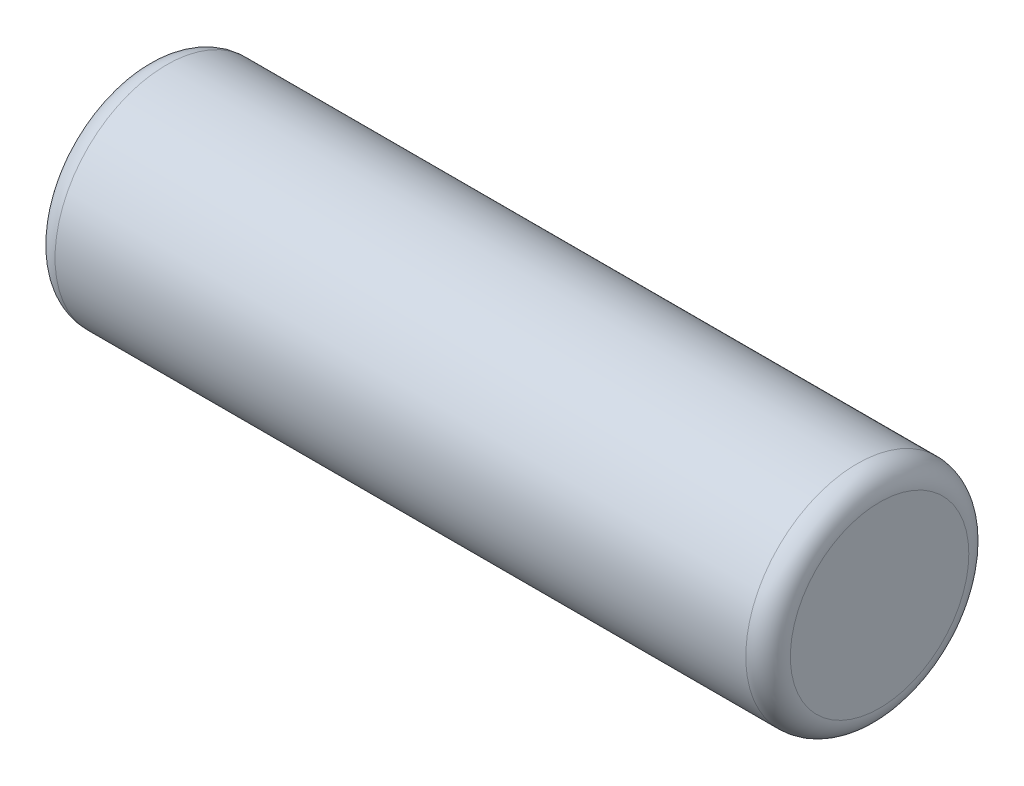
ISO-10303-21;
HEADER;
FILE_DESCRIPTION(('STEP AP214'),'2;1');
FILE_NAME('part.step','',(''),(''),'','','');
FILE_SCHEMA(('AUTOMOTIVE_DESIGN { 1 0 10303 214 1 1 1 1 }'));
ENDSEC;
DATA;
#1=APPLICATION_CONTEXT('core data for automotive mechanical design processes');
#2=APPLICATION_PROTOCOL_DEFINITION('international standard','automotive_design',2000,#1);
#3=PRODUCT_CONTEXT('',#1,'mechanical');
#4=PRODUCT('Part','Part','',(#3));
#5=PRODUCT_RELATED_PRODUCT_CATEGORY('part','',(#4));
#6=PRODUCT_DEFINITION_FORMATION('','',#4);
#7=PRODUCT_DEFINITION_CONTEXT('part definition',#1,'design');
#8=PRODUCT_DEFINITION('design','',#6,#7);
#9=PRODUCT_DEFINITION_SHAPE('','',#8);
#10=(LENGTH_UNIT() NAMED_UNIT(*) SI_UNIT(.MILLI.,.METRE.));
#11=(NAMED_UNIT(*) PLANE_ANGLE_UNIT() SI_UNIT($,.RADIAN.));
#12=(NAMED_UNIT(*) SI_UNIT($,.STERADIAN.) SOLID_ANGLE_UNIT());
#13=UNCERTAINTY_MEASURE_WITH_UNIT(LENGTH_MEASURE(1.E-05),#10,'distance_accuracy_value','');
#14=(GEOMETRIC_REPRESENTATION_CONTEXT(3) GLOBAL_UNCERTAINTY_ASSIGNED_CONTEXT((#13)) GLOBAL_UNIT_ASSIGNED_CONTEXT((#10,
#11,#12)) REPRESENTATION_CONTEXT('',''));
#15=CARTESIAN_POINT('',(0.,0.,0.));
#16=DIRECTION('',(0.,0.,1.));
#17=DIRECTION('',(1.,0.,0.));
#18=AXIS2_PLACEMENT_3D('',#15,#16,#17);
#19=CARTESIAN_POINT('',(0.,0.,0.));
#20=DIRECTION('',(1.,0.,0.));
#21=DIRECTION('',(0.,0.,-1.));
#22=AXIS2_PLACEMENT_3D('',#19,#20,#21);
#23=PLANE('',#22);
#24=CARTESIAN_POINT('',(0.,0.,0.));
#25=DIRECTION('',(1.,0.,0.));
#26=DIRECTION('',(0.,0.,-1.));
#27=AXIS2_PLACEMENT_3D('',#24,#25,#26);
#28=CIRCLE('',#27,1.82000000000003);
#29=CARTESIAN_POINT('',(0.,0.,-1.82000000000003));
#30=VERTEX_POINT('',#29);
#31=EDGE_CURVE('E30',#30,#30,#28,.T.);
#32=ORIENTED_EDGE('',*,*,#31,.F.);
#33=EDGE_LOOP('',(#32));
#34=FACE_BOUND('',#33,.T.);
#35=ADVANCED_FACE('F15',(#34),#23,.F.);
#36=CARTESIAN_POINT('',(0.454999999999963,0.,0.));
#37=DIRECTION('',(1.,0.,0.));
#38=DIRECTION('',(0.,0.,-1.));
#39=AXIS2_PLACEMENT_3D('',#36,#37,#38);
#40=TOROIDAL_SURFACE('',#39,1.82000000000003,0.454999999999963);
#41=ORIENTED_EDGE('',*,*,#31,.T.);
#42=EDGE_LOOP('',(#41));
#43=FACE_BOUND('',#42,.T.);
#44=CARTESIAN_POINT('',(0.455,0.,0.));
#45=DIRECTION('',(1.,0.,0.));
#46=DIRECTION('',(0.,0.,-1.));
#47=AXIS2_PLACEMENT_3D('',#44,#45,#46);
#48=CIRCLE('',#47,2.275);
#49=CARTESIAN_POINT('',(0.455,0.,-2.275));
#50=VERTEX_POINT('',#49);
#51=EDGE_CURVE('E26',#50,#50,#48,.T.);
#52=ORIENTED_EDGE('',*,*,#51,.F.);
#53=EDGE_LOOP('',(#52));
#54=FACE_BOUND('',#53,.T.);
#55=ADVANCED_FACE('F36',(#43,#54),#40,.T.);
#56=CARTESIAN_POINT('',(15.,0.,0.));
#57=DIRECTION('',(1.,0.,0.));
#58=DIRECTION('',(0.,0.,-1.));
#59=AXIS2_PLACEMENT_3D('',#56,#57,#58);
#60=CYLINDRICAL_SURFACE('',#59,2.275);
#61=CARTESIAN_POINT('',(14.545,0.,0.));
#62=DIRECTION('',(1.,0.,0.));
#63=DIRECTION('',(0.,0.,-1.));
#64=AXIS2_PLACEMENT_3D('',#61,#62,#63);
#65=CIRCLE('',#64,2.275);
#66=CARTESIAN_POINT('',(14.545,0.,-2.275));
#67=VERTEX_POINT('',#66);
#68=EDGE_CURVE('E22',#67,#67,#65,.T.);
#69=ORIENTED_EDGE('',*,*,#68,.F.);
#70=EDGE_LOOP('',(#69));
#71=FACE_BOUND('',#70,.T.);
#72=ORIENTED_EDGE('',*,*,#51,.T.);
#73=EDGE_LOOP('',(#72));
#74=FACE_BOUND('',#73,.T.);
#75=ADVANCED_FACE('F45',(#71,#74),#60,.T.);
#76=CARTESIAN_POINT('',(14.5450000000002,0.,0.));
#77=DIRECTION('',(1.,0.,0.));
#78=DIRECTION('',(0.,0.,-1.));
#79=AXIS2_PLACEMENT_3D('',#76,#77,#78);
#80=TOROIDAL_SURFACE('',#79,1.82000000000024,0.454999999999758);
#81=ORIENTED_EDGE('',*,*,#68,.T.);
#82=EDGE_LOOP('',(#81));
#83=FACE_BOUND('',#82,.T.);
#84=CARTESIAN_POINT('',(15.,0.,0.));
#85=DIRECTION('',(1.,0.,0.));
#86=DIRECTION('',(0.,0.,-1.));
#87=AXIS2_PLACEMENT_3D('',#84,#85,#86);
#88=CIRCLE('',#87,1.82000000000024);
#89=CARTESIAN_POINT('',(15.,0.,-1.82000000000024));
#90=VERTEX_POINT('',#89);
#91=EDGE_CURVE('E10',#90,#90,#88,.T.);
#92=ORIENTED_EDGE('',*,*,#91,.F.);
#93=EDGE_LOOP('',(#92));
#94=FACE_BOUND('',#93,.T.);
#95=ADVANCED_FACE('F49',(#83,#94),#80,.T.);
#96=CARTESIAN_POINT('',(15.,1.82,0.));
#97=DIRECTION('',(-1.,0.,0.));
#98=DIRECTION('',(0.,0.,1.));
#99=AXIS2_PLACEMENT_3D('',#96,#97,#98);
#100=PLANE('',#99);
#101=ORIENTED_EDGE('',*,*,#91,.T.);
#102=EDGE_LOOP('',(#101));
#103=FACE_BOUND('',#102,.T.);
#104=ADVANCED_FACE('F17',(#103),#100,.F.);
#105=CLOSED_SHELL('',(#35,#55,#75,#95,#104));
#106=MANIFOLD_SOLID_BREP('B1',#105);
#107=ADVANCED_BREP_SHAPE_REPRESENTATION('',(#18,#106),#14);
#108=SHAPE_DEFINITION_REPRESENTATION(#9,#107);
ENDSEC;
END-ISO-10303-21;
